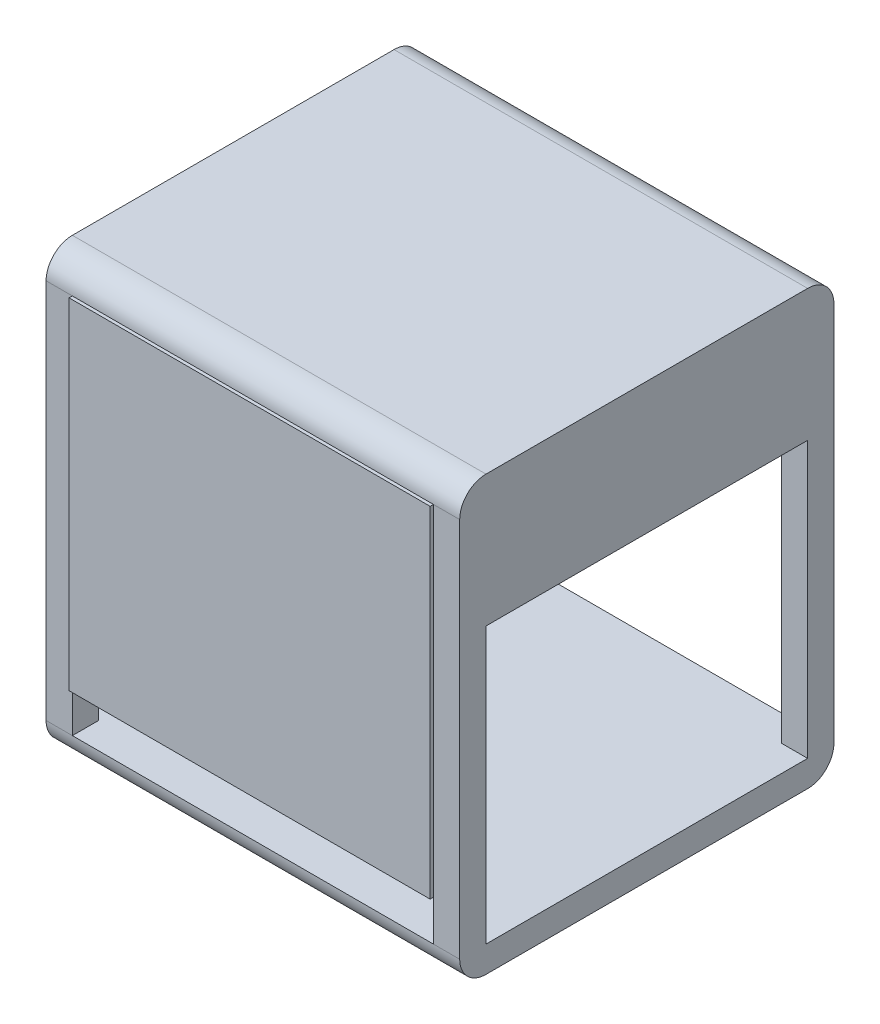
ISO-10303-21;
HEADER;
FILE_DESCRIPTION(('STEP AP214'),'2;1');
FILE_NAME('part.step','',(''),(''),'','','');
FILE_SCHEMA(('AUTOMOTIVE_DESIGN { 1 0 10303 214 1 1 1 1 }'));
ENDSEC;
DATA;
#1=APPLICATION_CONTEXT('core data for automotive mechanical design processes');
#2=APPLICATION_PROTOCOL_DEFINITION('international standard','automotive_design',2000,#1);
#3=PRODUCT_CONTEXT('',#1,'mechanical');
#4=PRODUCT('Part','Part','',(#3));
#5=PRODUCT_RELATED_PRODUCT_CATEGORY('part','',(#4));
#6=PRODUCT_DEFINITION_FORMATION('','',#4);
#7=PRODUCT_DEFINITION_CONTEXT('part definition',#1,'design');
#8=PRODUCT_DEFINITION('design','',#6,#7);
#9=PRODUCT_DEFINITION_SHAPE('','',#8);
#10=(LENGTH_UNIT() NAMED_UNIT(*) SI_UNIT(.MILLI.,.METRE.));
#11=(NAMED_UNIT(*) PLANE_ANGLE_UNIT() SI_UNIT($,.RADIAN.));
#12=(NAMED_UNIT(*) SI_UNIT($,.STERADIAN.) SOLID_ANGLE_UNIT());
#13=UNCERTAINTY_MEASURE_WITH_UNIT(LENGTH_MEASURE(1.E-05),#10,'distance_accuracy_value','');
#14=(GEOMETRIC_REPRESENTATION_CONTEXT(3) GLOBAL_UNCERTAINTY_ASSIGNED_CONTEXT((#13)) GLOBAL_UNIT_ASSIGNED_CONTEXT((#10,
#11,#12)) REPRESENTATION_CONTEXT('',''));
#15=CARTESIAN_POINT('',(0.,0.,0.));
#16=DIRECTION('',(0.,0.,1.));
#17=DIRECTION('',(1.,0.,0.));
#18=AXIS2_PLACEMENT_3D('',#15,#16,#17);
#19=CARTESIAN_POINT('',(590.,620.,5.));
#20=DIRECTION('',(-1.,0.,0.));
#21=DIRECTION('',(0.,0.,1.));
#22=AXIS2_PLACEMENT_3D('',#19,#20,#21);
#23=PLANE('',#22);
#24=DIRECTION('',(0.,1.,0.));
#25=VECTOR('',#24,1.);
#26=CARTESIAN_POINT('',(590.,620.,0.));
#27=LINE('',#26,#25);
#28=CARTESIAN_POINT('',(590.,101.80485531163,0.));
#29=VERTEX_POINT('',#28);
#30=CARTESIAN_POINT('',(590.,620.,0.));
#31=VERTEX_POINT('',#30);
#32=EDGE_CURVE('E108',#29,#31,#27,.T.);
#33=ORIENTED_EDGE('',*,*,#32,.T.);
#34=DIRECTION('',(0.,0.,-1.));
#35=VECTOR('',#34,1.);
#36=CARTESIAN_POINT('',(590.,620.,5.));
#37=LINE('',#36,#35);
#38=CARTESIAN_POINT('',(590.,620.,5.));
#39=VERTEX_POINT('',#38);
#40=EDGE_CURVE('E12',#39,#31,#37,.T.);
#41=ORIENTED_EDGE('',*,*,#40,.F.);
#42=DIRECTION('',(0.,1.,0.));
#43=VECTOR('',#42,1.);
#44=CARTESIAN_POINT('',(590.,620.,5.));
#45=LINE('',#44,#43);
#46=CARTESIAN_POINT('',(590.,101.80485531163,5.));
#47=VERTEX_POINT('',#46);
#48=EDGE_CURVE('E96',#47,#39,#45,.T.);
#49=ORIENTED_EDGE('',*,*,#48,.F.);
#50=DIRECTION('',(0.,0.,-1.));
#51=VECTOR('',#50,1.);
#52=CARTESIAN_POINT('',(590.,101.80485531163,5.));
#53=LINE('',#52,#51);
#54=EDGE_CURVE('E104',#47,#29,#53,.T.);
#55=ORIENTED_EDGE('',*,*,#54,.T.);
#56=EDGE_LOOP('',(#33,#41,#49,#55));
#57=FACE_BOUND('',#56,.T.);
#58=ADVANCED_FACE('F45',(#57),#23,.F.);
#59=CARTESIAN_POINT('',(590.,620.,5.));
#60=DIRECTION('',(0.,-1.,0.));
#61=DIRECTION('',(0.,0.,-1.));
#62=AXIS2_PLACEMENT_3D('',#59,#60,#61);
#63=PLANE('',#62);
#64=DIRECTION('',(-1.,0.,0.));
#65=VECTOR('',#64,1.);
#66=CARTESIAN_POINT('',(590.,620.,0.));
#67=LINE('',#66,#65);
#68=CARTESIAN_POINT('',(40.,620.,0.));
#69=VERTEX_POINT('',#68);
#70=EDGE_CURVE('E100',#31,#69,#67,.T.);
#71=ORIENTED_EDGE('',*,*,#70,.T.);
#72=DIRECTION('',(0.,0.,-1.));
#73=VECTOR('',#72,1.);
#74=CARTESIAN_POINT('',(40.,620.,5.));
#75=LINE('',#74,#73);
#76=CARTESIAN_POINT('',(40.,620.,5.));
#77=VERTEX_POINT('',#76);
#78=EDGE_CURVE('E53',#77,#69,#75,.T.);
#79=ORIENTED_EDGE('',*,*,#78,.F.);
#80=DIRECTION('',(-1.,0.,0.));
#81=VECTOR('',#80,1.);
#82=CARTESIAN_POINT('',(590.,620.,5.));
#83=LINE('',#82,#81);
#84=EDGE_CURVE('E91',#39,#77,#83,.T.);
#85=ORIENTED_EDGE('',*,*,#84,.F.);
#86=ORIENTED_EDGE('',*,*,#40,.T.);
#87=EDGE_LOOP('',(#71,#79,#85,#86));
#88=FACE_BOUND('',#87,.T.);
#89=ADVANCED_FACE('F99',(#88),#63,.F.);
#90=CARTESIAN_POINT('',(40.,620.,5.));
#91=DIRECTION('',(1.,0.,0.));
#92=DIRECTION('',(0.,0.,-1.));
#93=AXIS2_PLACEMENT_3D('',#90,#91,#92);
#94=PLANE('',#93);
#95=DIRECTION('',(0.,-1.,0.));
#96=VECTOR('',#95,1.);
#97=CARTESIAN_POINT('',(40.,620.,0.));
#98=LINE('',#97,#96);
#99=CARTESIAN_POINT('',(40.,101.80485531163,0.));
#100=VERTEX_POINT('',#99);
#101=EDGE_CURVE('E78',#69,#100,#98,.T.);
#102=ORIENTED_EDGE('',*,*,#101,.T.);
#103=DIRECTION('',(0.,0.,-1.));
#104=VECTOR('',#103,1.);
#105=CARTESIAN_POINT('',(40.,101.80485531163,5.));
#106=LINE('',#105,#104);
#107=CARTESIAN_POINT('',(40.,101.80485531163,5.));
#108=VERTEX_POINT('',#107);
#109=EDGE_CURVE('E101',#108,#100,#106,.T.);
#110=ORIENTED_EDGE('',*,*,#109,.F.);
#111=DIRECTION('',(0.,-1.,0.));
#112=VECTOR('',#111,1.);
#113=CARTESIAN_POINT('',(40.,620.,5.));
#114=LINE('',#113,#112);
#115=EDGE_CURVE('E94',#77,#108,#114,.T.);
#116=ORIENTED_EDGE('',*,*,#115,.F.);
#117=ORIENTED_EDGE('',*,*,#78,.T.);
#118=EDGE_LOOP('',(#102,#110,#116,#117));
#119=FACE_BOUND('',#118,.T.);
#120=ADVANCED_FACE('F102',(#119),#94,.F.);
#121=CARTESIAN_POINT('',(590.,101.80485531163,5.));
#122=DIRECTION('',(0.,1.,0.));
#123=DIRECTION('',(0.,0.,1.));
#124=AXIS2_PLACEMENT_3D('',#121,#122,#123);
#125=PLANE('',#124);
#126=DIRECTION('',(1.,0.,0.));
#127=VECTOR('',#126,1.);
#128=CARTESIAN_POINT('',(590.,101.80485531163,0.));
#129=LINE('',#128,#127);
#130=EDGE_CURVE('E84',#100,#29,#129,.T.);
#131=ORIENTED_EDGE('',*,*,#130,.T.);
#132=ORIENTED_EDGE('',*,*,#54,.F.);
#133=DIRECTION('',(1.,0.,0.));
#134=VECTOR('',#133,1.);
#135=CARTESIAN_POINT('',(590.,101.80485531163,5.));
#136=LINE('',#135,#134);
#137=EDGE_CURVE('E61',#108,#47,#136,.T.);
#138=ORIENTED_EDGE('',*,*,#137,.F.);
#139=ORIENTED_EDGE('',*,*,#109,.T.);
#140=EDGE_LOOP('',(#131,#132,#138,#139));
#141=FACE_BOUND('',#140,.T.);
#142=ADVANCED_FACE('F115',(#141),#125,.F.);
#143=CARTESIAN_POINT('',(0.,0.,5.));
#144=DIRECTION('',(0.,0.,-1.));
#145=DIRECTION('',(-1.,0.,0.));
#146=AXIS2_PLACEMENT_3D('',#143,#144,#145);
#147=PLANE('',#146);
#148=ORIENTED_EDGE('',*,*,#48,.T.);
#149=ORIENTED_EDGE('',*,*,#84,.T.);
#150=ORIENTED_EDGE('',*,*,#115,.T.);
#151=ORIENTED_EDGE('',*,*,#137,.T.);
#152=EDGE_LOOP('',(#148,#149,#150,#151));
#153=FACE_BOUND('',#152,.T.);
#154=ADVANCED_FACE('F92',(#153),#147,.F.);
#155=CARTESIAN_POINT('',(0.,0.,0.));
#156=DIRECTION('',(0.,0.,-1.));
#157=DIRECTION('',(-1.,0.,0.));
#158=AXIS2_PLACEMENT_3D('',#155,#156,#157);
#159=PLANE('',#158);
#160=ORIENTED_EDGE('',*,*,#32,.F.);
#161=ORIENTED_EDGE('',*,*,#130,.F.);
#162=ORIENTED_EDGE('',*,*,#101,.F.);
#163=ORIENTED_EDGE('',*,*,#70,.F.);
#164=EDGE_LOOP('',(#160,#161,#162,#163));
#165=FACE_BOUND('',#164,.T.);
#166=ADVANCED_FACE('F118',(#165),#159,.T.);
#167=CLOSED_SHELL('',(#58,#89,#120,#142,#154,#166));
#168=MANIFOLD_SOLID_BREP('B2',#167);
#169=CARTESIAN_POINT('',(102.769624477169,316.904934276251,-276.727693756087));
#170=DIRECTION('',(0.,1.,0.));
#171=DIRECTION('',(0.,0.,1.));
#172=AXIS2_PLACEMENT_3D('',#169,#170,#171);
#173=PLANE('',#172);
#174=DIRECTION('',(0.,0.,-1.));
#175=VECTOR('',#174,1.);
#176=CARTESIAN_POINT('',(102.769624477169,316.904934276251,-276.727693756087));
#177=LINE('',#176,#175);
#178=CARTESIAN_POINT('',(102.769624477169,316.904934276251,-276.727693756087));
#179=VERTEX_POINT('',#178);
#180=CARTESIAN_POINT('',(102.769624477169,316.904934276251,-336.727693756087));
#181=VERTEX_POINT('',#180);
#182=EDGE_CURVE('E369',#179,#181,#177,.T.);
#183=ORIENTED_EDGE('',*,*,#182,.T.);
#184=DIRECTION('',(1.,0.,0.));
#185=VECTOR('',#184,1.);
#186=CARTESIAN_POINT('',(102.769624477169,316.904934276251,-336.727693756087));
#187=LINE('',#186,#185);
#188=CARTESIAN_POINT('',(181.340018819664,316.904934276251,-336.727693756087));
#189=VERTEX_POINT('',#188);
#190=EDGE_CURVE('E374',#181,#189,#187,.T.);
#191=ORIENTED_EDGE('',*,*,#190,.T.);
#192=DIRECTION('',(0.,0.,-1.));
#193=VECTOR('',#192,1.);
#194=CARTESIAN_POINT('',(181.340018819664,316.904934276251,-276.727693756087));
#195=LINE('',#194,#193);
#196=CARTESIAN_POINT('',(181.340018819664,316.904934276251,-276.727693756087));
#197=VERTEX_POINT('',#196);
#198=EDGE_CURVE('E384',#197,#189,#195,.T.);
#199=ORIENTED_EDGE('',*,*,#198,.F.);
#200=DIRECTION('',(1.,0.,0.));
#201=VECTOR('',#200,1.);
#202=CARTESIAN_POINT('',(102.769624477169,316.904934276251,-276.727693756087));
#203=LINE('',#202,#201);
#204=EDGE_CURVE('E381',#179,#197,#203,.T.);
#205=ORIENTED_EDGE('',*,*,#204,.F.);
#206=EDGE_LOOP('',(#183,#191,#199,#205));
#207=FACE_BOUND('',#206,.T.);
#208=CARTESIAN_POINT('',(141.069612941928,316.904934276251,-317.368211044439));
#209=DIRECTION('',(0.,1.,0.));
#210=DIRECTION('',(0.,0.,1.));
#211=AXIS2_PLACEMENT_3D('',#208,#209,#210);
#212=CIRCLE('',#211,11.2486982762184);
#213=CARTESIAN_POINT('',(141.069612941928,316.904934276251,-306.119512768221));
#214=VERTEX_POINT('',#213);
#215=EDGE_CURVE('E43',#214,#214,#212,.F.);
#216=ORIENTED_EDGE('',*,*,#215,.F.);
#217=EDGE_LOOP('',(#216));
#218=FACE_BOUND('',#217,.T.);
#219=ADVANCED_FACE('F168',(#207,#218),#173,.F.);
#220=CARTESIAN_POINT('',(40.,620.,660.));
#221=DIRECTION('',(0.,-1.,0.));
#222=DIRECTION('',(0.,0.,-1.));
#223=AXIS2_PLACEMENT_3D('',#220,#221,#222);
#224=PLANE('',#223);
#225=DIRECTION('',(1.,0.,0.));
#226=VECTOR('',#225,1.);
#227=CARTESIAN_POINT('',(40.,620.,-326.727693756087));
#228=LINE('',#227,#226);
#229=CARTESIAN_POINT('',(40.,620.,-326.727693756087));
#230=VERTEX_POINT('',#229);
#231=CARTESIAN_POINT('',(102.769624477169,620.,-326.727693756087));
#232=VERTEX_POINT('',#231);
#233=EDGE_CURVE('E583',#230,#232,#228,.T.);
#234=ORIENTED_EDGE('',*,*,#233,.T.);
#235=DIRECTION('',(0.,0.,-1.));
#236=VECTOR('',#235,1.);
#237=CARTESIAN_POINT('',(102.769624477169,620.,-276.727693756087));
#238=LINE('',#237,#236);
#239=CARTESIAN_POINT('',(102.769624477169,620.,-276.727693756087));
#240=VERTEX_POINT('',#239);
#241=EDGE_CURVE('E183',#240,#232,#238,.T.);
#242=ORIENTED_EDGE('',*,*,#241,.F.);
#243=DIRECTION('',(-1.,0.,0.));
#244=VECTOR('',#243,1.);
#245=CARTESIAN_POINT('',(102.769624477169,620.,-276.727693756087));
#246=LINE('',#245,#244);
#247=CARTESIAN_POINT('',(181.340018819664,620.,-276.727693756087));
#248=VERTEX_POINT('',#247);
#249=EDGE_CURVE('E187',#248,#240,#246,.T.);
#250=ORIENTED_EDGE('',*,*,#249,.F.);
#251=DIRECTION('',(0.,0.,-1.));
#252=VECTOR('',#251,1.);
#253=CARTESIAN_POINT('',(181.340018819664,620.,-276.727693756087));
#254=LINE('',#253,#252);
#255=CARTESIAN_POINT('',(181.340018819664,620.,-326.727693756087));
#256=VERTEX_POINT('',#255);
#257=EDGE_CURVE('E401',#248,#256,#254,.T.);
#258=ORIENTED_EDGE('',*,*,#257,.T.);
#259=CARTESIAN_POINT('',(590.,620.,-326.727693756087));
#260=VERTEX_POINT('',#259);
#261=EDGE_CURVE('E582',#256,#260,#228,.T.);
#262=ORIENTED_EDGE('',*,*,#261,.T.);
#263=DIRECTION('',(0.,0.,-1.));
#264=VECTOR('',#263,1.);
#265=CARTESIAN_POINT('',(590.,620.,660.));
#266=LINE('',#265,#264);
#267=CARTESIAN_POINT('',(590.,620.,0.));
#268=VERTEX_POINT('',#267);
#269=EDGE_CURVE('E483',#268,#260,#266,.T.);
#270=ORIENTED_EDGE('',*,*,#269,.F.);
#271=DIRECTION('',(1.,0.,0.));
#272=VECTOR('',#271,1.);
#273=CARTESIAN_POINT('',(0.,620.,0.));
#274=LINE('',#273,#272);
#275=CARTESIAN_POINT('',(40.,620.,0.));
#276=VERTEX_POINT('',#275);
#277=EDGE_CURVE('E574',#268,#276,#274,.F.);
#278=ORIENTED_EDGE('',*,*,#277,.T.);
#279=DIRECTION('',(0.,0.,-1.));
#280=VECTOR('',#279,1.);
#281=CARTESIAN_POINT('',(40.,620.,660.));
#282=LINE('',#281,#280);
#283=EDGE_CURVE('E479',#276,#230,#282,.T.);
#284=ORIENTED_EDGE('',*,*,#283,.T.);
#285=EDGE_LOOP('',(#234,#242,#250,#258,#262,#270,#278,#284));
#286=FACE_BOUND('',#285,.T.);
#287=ADVANCED_FACE('F610',(#286),#224,.T.);
#288=CARTESIAN_POINT('',(11.5967687641698,520.,-326.727693756087));
#289=DIRECTION('',(0.,0.,-1.));
#290=DIRECTION('',(-1.,0.,0.));
#291=AXIS2_PLACEMENT_3D('',#288,#289,#290);
#292=PLANE('',#291);
#293=DIRECTION('',(0.,-1.,0.));
#294=VECTOR('',#293,1.);
#295=CARTESIAN_POINT('',(102.769624477169,520.,-326.727693756087));
#296=LINE('',#295,#294);
#297=CARTESIAN_POINT('',(102.769624477169,520.,-326.727693756087));
#298=VERTEX_POINT('',#297);
#299=EDGE_CURVE('E406',#232,#298,#296,.T.);
#300=ORIENTED_EDGE('',*,*,#299,.F.);
#301=ORIENTED_EDGE('',*,*,#233,.F.);
#302=DIRECTION('',(0.,1.,0.));
#303=VECTOR('',#302,1.);
#304=CARTESIAN_POINT('',(40.,620.,-326.727693756087));
#305=LINE('',#304,#303);
#306=CARTESIAN_POINT('',(40.,520.,-326.727693756087));
#307=VERTEX_POINT('',#306);
#308=EDGE_CURVE('E418',#307,#230,#305,.T.);
#309=ORIENTED_EDGE('',*,*,#308,.F.);
#310=DIRECTION('',(-1.,0.,0.));
#311=VECTOR('',#310,1.);
#312=CARTESIAN_POINT('',(11.5967687641698,520.,-326.727693756087));
#313=LINE('',#312,#311);
#314=EDGE_CURVE('E411',#298,#307,#313,.T.);
#315=ORIENTED_EDGE('',*,*,#314,.F.);
#316=EDGE_LOOP('',(#300,#301,#309,#315));
#317=FACE_BOUND('',#316,.T.);
#318=ADVANCED_FACE('F617',(#317),#292,.F.);
#319=DIRECTION('',(0.,1.,0.));
#320=VECTOR('',#319,1.);
#321=CARTESIAN_POINT('',(181.340018819664,520.,-326.727693756087));
#322=LINE('',#321,#320);
#323=CARTESIAN_POINT('',(181.340018819664,520.,-326.727693756087));
#324=VERTEX_POINT('',#323);
#325=EDGE_CURVE('E383',#324,#256,#322,.T.);
#326=ORIENTED_EDGE('',*,*,#325,.F.);
#327=CARTESIAN_POINT('',(590.,520.,-326.727693756087));
#328=VERTEX_POINT('',#327);
#329=EDGE_CURVE('E412',#328,#324,#313,.T.);
#330=ORIENTED_EDGE('',*,*,#329,.F.);
#331=DIRECTION('',(0.,-1.,0.));
#332=VECTOR('',#331,1.);
#333=CARTESIAN_POINT('',(590.,620.,-326.727693756087));
#334=LINE('',#333,#332);
#335=EDGE_CURVE('E415',#260,#328,#334,.T.);
#336=ORIENTED_EDGE('',*,*,#335,.F.);
#337=ORIENTED_EDGE('',*,*,#261,.F.);
#338=EDGE_LOOP('',(#326,#330,#336,#337));
#339=FACE_BOUND('',#338,.T.);
#340=ADVANCED_FACE('F603',(#339),#292,.F.);
#341=CARTESIAN_POINT('',(0.,520.,0.));
#342=DIRECTION('',(0.,1.,0.));
#343=DIRECTION('',(0.,0.,1.));
#344=AXIS2_PLACEMENT_3D('',#341,#342,#343);
#345=PLANE('',#344);
#346=DIRECTION('',(0.,0.,-1.));
#347=VECTOR('',#346,1.);
#348=CARTESIAN_POINT('',(102.769624477169,520.,0.));
#349=LINE('',#348,#347);
#350=CARTESIAN_POINT('',(102.769624477169,520.,-336.727693756087));
#351=VERTEX_POINT('',#350);
#352=EDGE_CURVE('E176',#298,#351,#349,.T.);
#353=ORIENTED_EDGE('',*,*,#352,.F.);
#354=ORIENTED_EDGE('',*,*,#314,.T.);
#355=DIRECTION('',(0.,0.,1.));
#356=VECTOR('',#355,1.);
#357=CARTESIAN_POINT('',(40.,520.,660.));
#358=LINE('',#357,#356);
#359=CARTESIAN_POINT('',(40.,520.,-374.305064206949));
#360=VERTEX_POINT('',#359);
#361=EDGE_CURVE('E427',#360,#307,#358,.T.);
#362=ORIENTED_EDGE('',*,*,#361,.F.);
#363=DIRECTION('',(1.,0.,0.));
#364=VECTOR('',#363,1.);
#365=CARTESIAN_POINT('',(11.5967687641698,520.,-374.305064206949));
#366=LINE('',#365,#364);
#367=CARTESIAN_POINT('',(590.,520.,-374.305064206949));
#368=VERTEX_POINT('',#367);
#369=EDGE_CURVE('E408',#360,#368,#366,.T.);
#370=ORIENTED_EDGE('',*,*,#369,.T.);
#371=DIRECTION('',(0.,0.,-1.));
#372=VECTOR('',#371,1.);
#373=CARTESIAN_POINT('',(590.,520.,660.));
#374=LINE('',#373,#372);
#375=EDGE_CURVE('E588',#328,#368,#374,.T.);
#376=ORIENTED_EDGE('',*,*,#375,.F.);
#377=ORIENTED_EDGE('',*,*,#329,.T.);
#378=DIRECTION('',(0.,0.,1.));
#379=VECTOR('',#378,1.);
#380=CARTESIAN_POINT('',(181.340018819664,520.,0.));
#381=LINE('',#380,#379);
#382=CARTESIAN_POINT('',(181.340018819664,520.,-336.727693756087));
#383=VERTEX_POINT('',#382);
#384=EDGE_CURVE('E593',#383,#324,#381,.T.);
#385=ORIENTED_EDGE('',*,*,#384,.F.);
#386=DIRECTION('',(1.,0.,0.));
#387=VECTOR('',#386,1.);
#388=CARTESIAN_POINT('',(0.,520.,-336.727693756087));
#389=LINE('',#388,#387);
#390=EDGE_CURVE('E591',#351,#383,#389,.T.);
#391=ORIENTED_EDGE('',*,*,#390,.F.);
#392=EDGE_LOOP('',(#353,#354,#362,#370,#376,#377,#385,#391));
#393=FACE_BOUND('',#392,.T.);
#394=ADVANCED_FACE('F599',(#393),#345,.F.);
#395=CARTESIAN_POINT('',(40.,620.,660.));
#396=DIRECTION('',(1.,0.,0.));
#397=DIRECTION('',(0.,0.,-1.));
#398=AXIS2_PLACEMENT_3D('',#395,#396,#397);
#399=PLANE('',#398);
#400=CARTESIAN_POINT('',(40.,620.,-374.305064206949));
#401=VERTEX_POINT('',#400);
#402=CARTESIAN_POINT('',(40.,620.,-570.));
#403=VERTEX_POINT('',#402);
#404=EDGE_CURVE('E478',#401,#403,#282,.T.);
#405=ORIENTED_EDGE('',*,*,#404,.F.);
#406=DIRECTION('',(0.,-1.,0.));
#407=VECTOR('',#406,1.);
#408=CARTESIAN_POINT('',(40.,620.,-374.305064206949));
#409=LINE('',#408,#407);
#410=EDGE_CURVE('E424',#401,#360,#409,.T.);
#411=ORIENTED_EDGE('',*,*,#410,.T.);
#412=ORIENTED_EDGE('',*,*,#361,.T.);
#413=ORIENTED_EDGE('',*,*,#308,.T.);
#414=ORIENTED_EDGE('',*,*,#283,.F.);
#415=DIRECTION('',(0.,-1.,0.));
#416=VECTOR('',#415,1.);
#417=CARTESIAN_POINT('',(40.,660.,0.));
#418=LINE('',#417,#416);
#419=CARTESIAN_POINT('',(40.,40.,0.));
#420=VERTEX_POINT('',#419);
#421=EDGE_CURVE('E506',#276,#420,#418,.T.);
#422=ORIENTED_EDGE('',*,*,#421,.T.);
#423=DIRECTION('',(0.,0.,-1.));
#424=VECTOR('',#423,1.);
#425=CARTESIAN_POINT('',(40.,40.,660.));
#426=LINE('',#425,#424);
#427=CARTESIAN_POINT('',(40.,40.,-40.));
#428=VERTEX_POINT('',#427);
#429=EDGE_CURVE('E491',#420,#428,#426,.T.);
#430=ORIENTED_EDGE('',*,*,#429,.T.);
#431=DIRECTION('',(0.,1.,0.));
#432=VECTOR('',#431,1.);
#433=CARTESIAN_POINT('',(40.,620.,-40.));
#434=LINE('',#433,#432);
#435=CARTESIAN_POINT('',(40.,459.595995266071,-40.));
#436=VERTEX_POINT('',#435);
#437=EDGE_CURVE('E459',#428,#436,#434,.T.);
#438=ORIENTED_EDGE('',*,*,#437,.T.);
#439=DIRECTION('',(0.,0.,-1.));
#440=VECTOR('',#439,1.);
#441=CARTESIAN_POINT('',(40.,459.595995266071,660.));
#442=LINE('',#441,#440);
#443=CARTESIAN_POINT('',(40.,459.595995266071,-530.));
#444=VERTEX_POINT('',#443);
#445=EDGE_CURVE('E467',#436,#444,#442,.T.);
#446=ORIENTED_EDGE('',*,*,#445,.T.);
#447=DIRECTION('',(0.,-1.,0.));
#448=VECTOR('',#447,1.);
#449=CARTESIAN_POINT('',(40.,620.,-530.));
#450=LINE('',#449,#448);
#451=CARTESIAN_POINT('',(40.,40.,-530.));
#452=VERTEX_POINT('',#451);
#453=EDGE_CURVE('E448',#444,#452,#450,.T.);
#454=ORIENTED_EDGE('',*,*,#453,.T.);
#455=CARTESIAN_POINT('',(40.,40.,-570.));
#456=VERTEX_POINT('',#455);
#457=EDGE_CURVE('E490',#452,#456,#426,.T.);
#458=ORIENTED_EDGE('',*,*,#457,.T.);
#459=DIRECTION('',(0.,1.,0.));
#460=VECTOR('',#459,1.);
#461=CARTESIAN_POINT('',(40.,660.,-570.));
#462=LINE('',#461,#460);
#463=EDGE_CURVE('E503',#456,#403,#462,.T.);
#464=ORIENTED_EDGE('',*,*,#463,.T.);
#465=EDGE_LOOP('',(#405,#411,#412,#413,#414,#422,#430,#438,#446,#454,#458,#464));
#466=FACE_BOUND('',#465,.T.);
#467=ADVANCED_FACE('F622',(#466),#399,.T.);
#468=CARTESIAN_POINT('',(590.,620.,660.));
#469=DIRECTION('',(-1.,0.,0.));
#470=DIRECTION('',(0.,0.,1.));
#471=AXIS2_PLACEMENT_3D('',#468,#469,#470);
#472=PLANE('',#471);
#473=ORIENTED_EDGE('',*,*,#375,.T.);
#474=DIRECTION('',(0.,1.,0.));
#475=VECTOR('',#474,1.);
#476=CARTESIAN_POINT('',(590.,620.,-374.305064206949));
#477=LINE('',#476,#475);
#478=CARTESIAN_POINT('',(590.,620.,-374.305064206949));
#479=VERTEX_POINT('',#478);
#480=EDGE_CURVE('E421',#368,#479,#477,.T.);
#481=ORIENTED_EDGE('',*,*,#480,.T.);
#482=CARTESIAN_POINT('',(590.,620.,-570.));
#483=VERTEX_POINT('',#482);
#484=EDGE_CURVE('E482',#479,#483,#266,.T.);
#485=ORIENTED_EDGE('',*,*,#484,.T.);
#486=DIRECTION('',(0.,-1.,0.));
#487=VECTOR('',#486,1.);
#488=CARTESIAN_POINT('',(590.,660.,-570.));
#489=LINE('',#488,#487);
#490=CARTESIAN_POINT('',(590.,40.,-570.));
#491=VERTEX_POINT('',#490);
#492=EDGE_CURVE('E497',#483,#491,#489,.T.);
#493=ORIENTED_EDGE('',*,*,#492,.T.);
#494=DIRECTION('',(0.,0.,-1.));
#495=VECTOR('',#494,1.);
#496=CARTESIAN_POINT('',(590.,40.,660.));
#497=LINE('',#496,#495);
#498=CARTESIAN_POINT('',(590.,40.,-530.));
#499=VERTEX_POINT('',#498);
#500=EDGE_CURVE('E486',#499,#491,#497,.T.);
#501=ORIENTED_EDGE('',*,*,#500,.F.);
#502=DIRECTION('',(0.,1.,0.));
#503=VECTOR('',#502,1.);
#504=CARTESIAN_POINT('',(590.,620.,-530.));
#505=LINE('',#504,#503);
#506=CARTESIAN_POINT('',(590.,459.595995266071,-530.));
#507=VERTEX_POINT('',#506);
#508=EDGE_CURVE('E445',#499,#507,#505,.T.);
#509=ORIENTED_EDGE('',*,*,#508,.T.);
#510=DIRECTION('',(0.,0.,1.));
#511=VECTOR('',#510,1.);
#512=CARTESIAN_POINT('',(590.,459.595995266071,660.));
#513=LINE('',#512,#511);
#514=CARTESIAN_POINT('',(590.,459.595995266071,-40.));
#515=VERTEX_POINT('',#514);
#516=EDGE_CURVE('E578',#507,#515,#513,.T.);
#517=ORIENTED_EDGE('',*,*,#516,.T.);
#518=DIRECTION('',(0.,-1.,0.));
#519=VECTOR('',#518,1.);
#520=CARTESIAN_POINT('',(590.,620.,-40.));
#521=LINE('',#520,#519);
#522=CARTESIAN_POINT('',(590.,40.,-40.));
#523=VERTEX_POINT('',#522);
#524=EDGE_CURVE('E456',#515,#523,#521,.T.);
#525=ORIENTED_EDGE('',*,*,#524,.T.);
#526=CARTESIAN_POINT('',(590.,40.,0.));
#527=VERTEX_POINT('',#526);
#528=EDGE_CURVE('E487',#527,#523,#497,.T.);
#529=ORIENTED_EDGE('',*,*,#528,.F.);
#530=DIRECTION('',(0.,1.,0.));
#531=VECTOR('',#530,1.);
#532=CARTESIAN_POINT('',(590.,660.,0.));
#533=LINE('',#532,#531);
#534=EDGE_CURVE('E500',#527,#268,#533,.T.);
#535=ORIENTED_EDGE('',*,*,#534,.T.);
#536=ORIENTED_EDGE('',*,*,#269,.T.);
#537=ORIENTED_EDGE('',*,*,#335,.T.);
#538=EDGE_LOOP('',(#473,#481,#485,#493,#501,#509,#517,#525,#529,#535,#536,#537));
#539=FACE_BOUND('',#538,.T.);
#540=ADVANCED_FACE('F606',(#539),#472,.T.);
#541=ORIENTED_EDGE('',*,*,#484,.F.);
#542=DIRECTION('',(-1.,0.,0.));
#543=VECTOR('',#542,1.);
#544=CARTESIAN_POINT('',(40.,620.,-374.305064206949));
#545=LINE('',#544,#543);
#546=EDGE_CURVE('E585',#479,#401,#545,.T.);
#547=ORIENTED_EDGE('',*,*,#546,.T.);
#548=ORIENTED_EDGE('',*,*,#404,.T.);
#549=DIRECTION('',(-1.,0.,0.));
#550=VECTOR('',#549,1.);
#551=CARTESIAN_POINT('',(0.,620.,-570.));
#552=LINE('',#551,#550);
#553=EDGE_CURVE('E494',#483,#403,#552,.T.);
#554=ORIENTED_EDGE('',*,*,#553,.F.);
#555=EDGE_LOOP('',(#541,#547,#548,#554));
#556=FACE_BOUND('',#555,.T.);
#557=ADVANCED_FACE('F688',(#556),#224,.T.);
#558=CARTESIAN_POINT('',(0.,660.,0.));
#559=DIRECTION('',(1.,0.,0.));
#560=DIRECTION('',(0.,0.,-1.));
#561=AXIS2_PLACEMENT_3D('',#558,#559,#560);
#562=PLANE('',#561);
#563=DIRECTION('',(0.,-1.,0.));
#564=VECTOR('',#563,1.);
#565=CARTESIAN_POINT('',(0.,660.,-570.));
#566=LINE('',#565,#564);
#567=CARTESIAN_POINT('',(0.,620.,-570.));
#568=VERTEX_POINT('',#567);
#569=CARTESIAN_POINT('',(0.,40.,-570.));
#570=VERTEX_POINT('',#569);
#571=EDGE_CURVE('E519',#568,#570,#566,.T.);
#572=ORIENTED_EDGE('',*,*,#571,.T.);
#573=CARTESIAN_POINT('',(0.,40.,-530.));
#574=DIRECTION('',(1.,0.,0.));
#575=DIRECTION('',(0.,0.,-1.));
#576=AXIS2_PLACEMENT_3D('',#573,#574,#575);
#577=CIRCLE('',#576,40.);
#578=CARTESIAN_POINT('',(0.,0.,-530.));
#579=VERTEX_POINT('',#578);
#580=EDGE_CURVE('E549',#570,#579,#577,.F.);
#581=ORIENTED_EDGE('',*,*,#580,.T.);
#582=DIRECTION('',(0.,0.,1.));
#583=VECTOR('',#582,1.);
#584=CARTESIAN_POINT('',(0.,0.,0.));
#585=LINE('',#584,#583);
#586=CARTESIAN_POINT('',(0.,0.,-40.));
#587=VERTEX_POINT('',#586);
#588=EDGE_CURVE('E511',#579,#587,#585,.T.);
#589=ORIENTED_EDGE('',*,*,#588,.T.);
#590=CARTESIAN_POINT('',(0.,40.,-40.));
#591=DIRECTION('',(1.,0.,0.));
#592=DIRECTION('',(0.,0.,-1.));
#593=AXIS2_PLACEMENT_3D('',#590,#591,#592);
#594=CIRCLE('',#593,40.);
#595=CARTESIAN_POINT('',(0.,40.,0.));
#596=VERTEX_POINT('',#595);
#597=EDGE_CURVE('E545',#587,#596,#594,.F.);
#598=ORIENTED_EDGE('',*,*,#597,.T.);
#599=DIRECTION('',(0.,-1.,0.));
#600=VECTOR('',#599,1.);
#601=CARTESIAN_POINT('',(0.,660.,0.));
#602=LINE('',#601,#600);
#603=CARTESIAN_POINT('',(0.,620.,0.));
#604=VERTEX_POINT('',#603);
#605=EDGE_CURVE('E532',#604,#596,#602,.T.);
#606=ORIENTED_EDGE('',*,*,#605,.F.);
#607=CARTESIAN_POINT('',(0.,620.,-40.));
#608=DIRECTION('',(1.,0.,0.));
#609=DIRECTION('',(0.,0.,-1.));
#610=AXIS2_PLACEMENT_3D('',#607,#608,#609);
#611=CIRCLE('',#610,40.);
#612=CARTESIAN_POINT('',(0.,660.,-40.));
#613=VERTEX_POINT('',#612);
#614=EDGE_CURVE('E543',#604,#613,#611,.F.);
#615=ORIENTED_EDGE('',*,*,#614,.T.);
#616=DIRECTION('',(0.,0.,1.));
#617=VECTOR('',#616,1.);
#618=CARTESIAN_POINT('',(0.,660.,0.));
#619=LINE('',#618,#617);
#620=CARTESIAN_POINT('',(0.,660.,-530.));
#621=VERTEX_POINT('',#620);
#622=EDGE_CURVE('E512',#621,#613,#619,.T.);
#623=ORIENTED_EDGE('',*,*,#622,.F.);
#624=CARTESIAN_POINT('',(0.,620.,-530.));
#625=DIRECTION('',(1.,0.,0.));
#626=DIRECTION('',(0.,0.,-1.));
#627=AXIS2_PLACEMENT_3D('',#624,#625,#626);
#628=CIRCLE('',#627,40.);
#629=EDGE_CURVE('E547',#621,#568,#628,.F.);
#630=ORIENTED_EDGE('',*,*,#629,.T.);
#631=EDGE_LOOP('',(#572,#581,#589,#598,#606,#615,#623,#630));
#632=FACE_BOUND('',#631,.T.);
#633=DIRECTION('',(0.,1.,0.));
#634=VECTOR('',#633,1.);
#635=CARTESIAN_POINT('',(0.,660.,-40.));
#636=LINE('',#635,#634);
#637=CARTESIAN_POINT('',(0.,40.,-40.));
#638=VERTEX_POINT('',#637);
#639=CARTESIAN_POINT('',(0.,459.595995266071,-40.));
#640=VERTEX_POINT('',#639);
#641=EDGE_CURVE('E464',#638,#640,#636,.T.);
#642=ORIENTED_EDGE('',*,*,#641,.F.);
#643=DIRECTION('',(0.,0.,1.));
#644=VECTOR('',#643,1.);
#645=CARTESIAN_POINT('',(0.,40.,0.));
#646=LINE('',#645,#644);
#647=CARTESIAN_POINT('',(0.,40.,-530.));
#648=VERTEX_POINT('',#647);
#649=EDGE_CURVE('E476',#648,#638,#646,.T.);
#650=ORIENTED_EDGE('',*,*,#649,.F.);
#651=DIRECTION('',(0.,-1.,0.));
#652=VECTOR('',#651,1.);
#653=CARTESIAN_POINT('',(0.,660.,-530.));
#654=LINE('',#653,#652);
#655=CARTESIAN_POINT('',(0.,459.595995266071,-530.));
#656=VERTEX_POINT('',#655);
#657=EDGE_CURVE('E454',#656,#648,#654,.T.);
#658=ORIENTED_EDGE('',*,*,#657,.F.);
#659=DIRECTION('',(0.,0.,-1.));
#660=VECTOR('',#659,1.);
#661=CARTESIAN_POINT('',(0.,459.595995266071,0.));
#662=LINE('',#661,#660);
#663=EDGE_CURVE('E472',#640,#656,#662,.T.);
#664=ORIENTED_EDGE('',*,*,#663,.F.);
#665=EDGE_LOOP('',(#642,#650,#658,#664));
#666=FACE_BOUND('',#665,.T.);
#667=ADVANCED_FACE('F635',(#632,#666),#562,.F.);
#668=CARTESIAN_POINT('',(630.,660.,0.));
#669=DIRECTION('',(-1.,0.,0.));
#670=DIRECTION('',(0.,0.,1.));
#671=AXIS2_PLACEMENT_3D('',#668,#669,#670);
#672=PLANE('',#671);
#673=DIRECTION('',(0.,0.,-1.));
#674=VECTOR('',#673,1.);
#675=CARTESIAN_POINT('',(630.,0.,0.));
#676=LINE('',#675,#674);
#677=CARTESIAN_POINT('',(630.,0.,-40.));
#678=VERTEX_POINT('',#677);
#679=CARTESIAN_POINT('',(630.,0.,-530.));
#680=VERTEX_POINT('',#679);
#681=EDGE_CURVE('E516',#678,#680,#676,.T.);
#682=ORIENTED_EDGE('',*,*,#681,.T.);
#683=CARTESIAN_POINT('',(630.,40.,-530.));
#684=DIRECTION('',(-1.,0.,0.));
#685=DIRECTION('',(0.,0.,1.));
#686=AXIS2_PLACEMENT_3D('',#683,#684,#685);
#687=CIRCLE('',#686,40.);
#688=CARTESIAN_POINT('',(630.,40.,-570.));
#689=VERTEX_POINT('',#688);
#690=EDGE_CURVE('E561',#680,#689,#687,.F.);
#691=ORIENTED_EDGE('',*,*,#690,.T.);
#692=DIRECTION('',(0.,-1.,0.));
#693=VECTOR('',#692,1.);
#694=CARTESIAN_POINT('',(630.,660.,-570.));
#695=LINE('',#694,#693);
#696=CARTESIAN_POINT('',(630.,620.,-570.));
#697=VERTEX_POINT('',#696);
#698=EDGE_CURVE('E526',#697,#689,#695,.T.);
#699=ORIENTED_EDGE('',*,*,#698,.F.);
#700=CARTESIAN_POINT('',(630.,620.,-530.));
#701=DIRECTION('',(-1.,0.,0.));
#702=DIRECTION('',(0.,0.,1.));
#703=AXIS2_PLACEMENT_3D('',#700,#701,#702);
#704=CIRCLE('',#703,40.);
#705=CARTESIAN_POINT('',(630.,660.,-530.));
#706=VERTEX_POINT('',#705);
#707=EDGE_CURVE('E559',#697,#706,#704,.F.);
#708=ORIENTED_EDGE('',*,*,#707,.T.);
#709=DIRECTION('',(0.,0.,-1.));
#710=VECTOR('',#709,1.);
#711=CARTESIAN_POINT('',(630.,660.,0.));
#712=LINE('',#711,#710);
#713=CARTESIAN_POINT('',(630.,660.,-40.));
#714=VERTEX_POINT('',#713);
#715=EDGE_CURVE('E515',#714,#706,#712,.T.);
#716=ORIENTED_EDGE('',*,*,#715,.F.);
#717=CARTESIAN_POINT('',(630.,620.,-40.));
#718=DIRECTION('',(-1.,0.,0.));
#719=DIRECTION('',(0.,0.,1.));
#720=AXIS2_PLACEMENT_3D('',#717,#718,#719);
#721=CIRCLE('',#720,40.);
#722=CARTESIAN_POINT('',(630.,620.,0.));
#723=VERTEX_POINT('',#722);
#724=EDGE_CURVE('E555',#714,#723,#721,.F.);
#725=ORIENTED_EDGE('',*,*,#724,.T.);
#726=DIRECTION('',(0.,-1.,0.));
#727=VECTOR('',#726,1.);
#728=CARTESIAN_POINT('',(630.,660.,0.));
#729=LINE('',#728,#727);
#730=CARTESIAN_POINT('',(630.,40.,0.));
#731=VERTEX_POINT('',#730);
#732=EDGE_CURVE('E529',#723,#731,#729,.T.);
#733=ORIENTED_EDGE('',*,*,#732,.T.);
#734=CARTESIAN_POINT('',(630.,40.,-40.));
#735=DIRECTION('',(-1.,0.,0.));
#736=DIRECTION('',(0.,0.,1.));
#737=AXIS2_PLACEMENT_3D('',#734,#735,#736);
#738=CIRCLE('',#737,40.);
#739=EDGE_CURVE('E557',#731,#678,#738,.F.);
#740=ORIENTED_EDGE('',*,*,#739,.T.);
#741=EDGE_LOOP('',(#682,#691,#699,#708,#716,#725,#733,#740));
#742=FACE_BOUND('',#741,.T.);
#743=DIRECTION('',(0.,-1.,0.));
#744=VECTOR('',#743,1.);
#745=CARTESIAN_POINT('',(630.,660.,-40.));
#746=LINE('',#745,#744);
#747=CARTESIAN_POINT('',(630.,459.595995266071,-40.));
#748=VERTEX_POINT('',#747);
#749=CARTESIAN_POINT('',(630.,40.,-40.));
#750=VERTEX_POINT('',#749);
#751=EDGE_CURVE('E462',#748,#750,#746,.T.);
#752=ORIENTED_EDGE('',*,*,#751,.F.);
#753=DIRECTION('',(0.,0.,1.));
#754=VECTOR('',#753,1.);
#755=CARTESIAN_POINT('',(630.,459.595995266071,0.));
#756=LINE('',#755,#754);
#757=CARTESIAN_POINT('',(630.,459.595995266071,-530.));
#758=VERTEX_POINT('',#757);
#759=EDGE_CURVE('E470',#758,#748,#756,.T.);
#760=ORIENTED_EDGE('',*,*,#759,.F.);
#761=DIRECTION('',(0.,1.,0.));
#762=VECTOR('',#761,1.);
#763=CARTESIAN_POINT('',(630.,660.,-530.));
#764=LINE('',#763,#762);
#765=CARTESIAN_POINT('',(630.,40.,-530.));
#766=VERTEX_POINT('',#765);
#767=EDGE_CURVE('E451',#766,#758,#764,.T.);
#768=ORIENTED_EDGE('',*,*,#767,.F.);
#769=DIRECTION('',(0.,0.,-1.));
#770=VECTOR('',#769,1.);
#771=CARTESIAN_POINT('',(630.,40.,0.));
#772=LINE('',#771,#770);
#773=EDGE_CURVE('E474',#750,#766,#772,.T.);
#774=ORIENTED_EDGE('',*,*,#773,.F.);
#775=EDGE_LOOP('',(#752,#760,#768,#774));
#776=FACE_BOUND('',#775,.T.);
#777=ADVANCED_FACE('F672',(#742,#776),#672,.F.);
#778=CARTESIAN_POINT('',(0.,660.,0.));
#779=DIRECTION('',(0.,0.,-1.));
#780=DIRECTION('',(-1.,0.,0.));
#781=AXIS2_PLACEMENT_3D('',#778,#779,#780);
#782=PLANE('',#781);
#783=ORIENTED_EDGE('',*,*,#421,.F.);
#784=EDGE_CURVE('E569',#276,#604,#274,.F.);
#785=ORIENTED_EDGE('',*,*,#784,.T.);
#786=ORIENTED_EDGE('',*,*,#605,.T.);
#787=DIRECTION('',(1.,0.,0.));
#788=VECTOR('',#787,1.);
#789=CARTESIAN_POINT('',(630.,40.,0.));
#790=LINE('',#789,#788);
#791=EDGE_CURVE('E575',#596,#420,#790,.T.);
#792=ORIENTED_EDGE('',*,*,#791,.T.);
#793=EDGE_LOOP('',(#783,#785,#786,#792));
#794=FACE_BOUND('',#793,.T.);
#795=ADVANCED_FACE('F626',(#794),#782,.F.);
#796=ORIENTED_EDGE('',*,*,#534,.F.);
#797=EDGE_CURVE('E573',#527,#731,#790,.T.);
#798=ORIENTED_EDGE('',*,*,#797,.T.);
#799=ORIENTED_EDGE('',*,*,#732,.F.);
#800=EDGE_CURVE('E570',#723,#268,#274,.F.);
#801=ORIENTED_EDGE('',*,*,#800,.T.);
#802=EDGE_LOOP('',(#796,#798,#799,#801));
#803=FACE_BOUND('',#802,.T.);
#804=ADVANCED_FACE('F670',(#803),#782,.F.);
#805=CARTESIAN_POINT('',(0.,660.,-570.));
#806=DIRECTION('',(0.,0.,1.));
#807=DIRECTION('',(1.,0.,0.));
#808=AXIS2_PLACEMENT_3D('',#805,#806,#807);
#809=PLANE('',#808);
#810=ORIENTED_EDGE('',*,*,#463,.F.);
#811=DIRECTION('',(-1.,0.,0.));
#812=VECTOR('',#811,1.);
#813=CARTESIAN_POINT('',(0.,40.,-570.));
#814=LINE('',#813,#812);
#815=EDGE_CURVE('E539',#456,#570,#814,.T.);
#816=ORIENTED_EDGE('',*,*,#815,.T.);
#817=ORIENTED_EDGE('',*,*,#571,.F.);
#818=DIRECTION('',(-1.,0.,0.));
#819=VECTOR('',#818,1.);
#820=CARTESIAN_POINT('',(0.,620.,-570.));
#821=LINE('',#820,#819);
#822=EDGE_CURVE('E536',#568,#403,#821,.F.);
#823=ORIENTED_EDGE('',*,*,#822,.T.);
#824=EDGE_LOOP('',(#810,#816,#817,#823));
#825=FACE_BOUND('',#824,.T.);
#826=ADVANCED_FACE('F649',(#825),#809,.F.);
#827=ORIENTED_EDGE('',*,*,#492,.F.);
#828=EDGE_CURVE('E535',#483,#697,#821,.F.);
#829=ORIENTED_EDGE('',*,*,#828,.T.);
#830=ORIENTED_EDGE('',*,*,#698,.T.);
#831=EDGE_CURVE('E540',#689,#491,#814,.T.);
#832=ORIENTED_EDGE('',*,*,#831,.T.);
#833=EDGE_LOOP('',(#827,#829,#830,#832));
#834=FACE_BOUND('',#833,.T.);
#835=ADVANCED_FACE('F678',(#834),#809,.F.);
#836=CARTESIAN_POINT('',(0.,660.,0.));
#837=DIRECTION('',(0.,-1.,0.));
#838=DIRECTION('',(0.,0.,-1.));
#839=AXIS2_PLACEMENT_3D('',#836,#837,#838);
#840=PLANE('',#839);
#841=ORIENTED_EDGE('',*,*,#715,.T.);
#842=DIRECTION('',(-1.,0.,0.));
#843=VECTOR('',#842,1.);
#844=CARTESIAN_POINT('',(0.,660.,-530.));
#845=LINE('',#844,#843);
#846=EDGE_CURVE('E566',#706,#621,#845,.T.);
#847=ORIENTED_EDGE('',*,*,#846,.T.);
#848=ORIENTED_EDGE('',*,*,#622,.T.);
#849=DIRECTION('',(1.,0.,0.));
#850=VECTOR('',#849,1.);
#851=CARTESIAN_POINT('',(0.,660.,-40.));
#852=LINE('',#851,#850);
#853=EDGE_CURVE('E563',#613,#714,#852,.T.);
#854=ORIENTED_EDGE('',*,*,#853,.T.);
#855=EDGE_LOOP('',(#841,#847,#848,#854));
#856=FACE_BOUND('',#855,.T.);
#857=ADVANCED_FACE('F638',(#856),#840,.F.);
#858=CARTESIAN_POINT('',(0.,0.,0.));
#859=DIRECTION('',(0.,-1.,0.));
#860=DIRECTION('',(0.,0.,-1.));
#861=AXIS2_PLACEMENT_3D('',#858,#859,#860);
#862=PLANE('',#861);
#863=ORIENTED_EDGE('',*,*,#588,.F.);
#864=DIRECTION('',(-1.,0.,0.));
#865=VECTOR('',#864,1.);
#866=CARTESIAN_POINT('',(630.,0.,-530.));
#867=LINE('',#866,#865);
#868=EDGE_CURVE('E553',#579,#680,#867,.F.);
#869=ORIENTED_EDGE('',*,*,#868,.T.);
#870=ORIENTED_EDGE('',*,*,#681,.F.);
#871=DIRECTION('',(1.,0.,0.));
#872=VECTOR('',#871,1.);
#873=CARTESIAN_POINT('',(0.,0.,-40.));
#874=LINE('',#873,#872);
#875=EDGE_CURVE('E551',#678,#587,#874,.F.);
#876=ORIENTED_EDGE('',*,*,#875,.T.);
#877=EDGE_LOOP('',(#863,#869,#870,#876));
#878=FACE_BOUND('',#877,.T.);
#879=ADVANCED_FACE('F659',(#878),#862,.T.);
#880=CARTESIAN_POINT('',(0.,40.,-530.));
#881=DIRECTION('',(1.,0.,0.));
#882=DIRECTION('',(0.,0.,-1.));
#883=AXIS2_PLACEMENT_3D('',#880,#881,#882);
#884=CYLINDRICAL_SURFACE('',#883,40.);
#885=ORIENTED_EDGE('',*,*,#690,.F.);
#886=ORIENTED_EDGE('',*,*,#868,.F.);
#887=ORIENTED_EDGE('',*,*,#580,.F.);
#888=ORIENTED_EDGE('',*,*,#815,.F.);
#889=DIRECTION('',(1.,0.,0.));
#890=VECTOR('',#889,1.);
#891=CARTESIAN_POINT('',(0.,40.,-570.));
#892=LINE('',#891,#890);
#893=EDGE_CURVE('E508',#456,#491,#892,.T.);
#894=ORIENTED_EDGE('',*,*,#893,.T.);
#895=ORIENTED_EDGE('',*,*,#831,.F.);
#896=EDGE_LOOP('',(#885,#886,#887,#888,#894,#895));
#897=FACE_BOUND('',#896,.T.);
#898=ADVANCED_FACE('F655',(#897),#884,.T.);
#899=CARTESIAN_POINT('',(0.,620.,-530.));
#900=DIRECTION('',(-1.,0.,0.));
#901=DIRECTION('',(0.,0.,1.));
#902=AXIS2_PLACEMENT_3D('',#899,#900,#901);
#903=CYLINDRICAL_SURFACE('',#902,40.);
#904=ORIENTED_EDGE('',*,*,#707,.F.);
#905=ORIENTED_EDGE('',*,*,#828,.F.);
#906=ORIENTED_EDGE('',*,*,#553,.T.);
#907=ORIENTED_EDGE('',*,*,#822,.F.);
#908=ORIENTED_EDGE('',*,*,#629,.F.);
#909=ORIENTED_EDGE('',*,*,#846,.F.);
#910=EDGE_LOOP('',(#904,#905,#906,#907,#908,#909));
#911=FACE_BOUND('',#910,.T.);
#912=ADVANCED_FACE('F643',(#911),#903,.T.);
#913=CARTESIAN_POINT('',(0.,40.,-40.));
#914=DIRECTION('',(-1.,0.,0.));
#915=DIRECTION('',(0.,0.,1.));
#916=AXIS2_PLACEMENT_3D('',#913,#914,#915);
#917=CYLINDRICAL_SURFACE('',#916,40.);
#918=ORIENTED_EDGE('',*,*,#597,.F.);
#919=ORIENTED_EDGE('',*,*,#875,.F.);
#920=ORIENTED_EDGE('',*,*,#739,.F.);
#921=ORIENTED_EDGE('',*,*,#797,.F.);
#922=EDGE_CURVE('E579',#420,#527,#790,.T.);
#923=ORIENTED_EDGE('',*,*,#922,.F.);
#924=ORIENTED_EDGE('',*,*,#791,.F.);
#925=EDGE_LOOP('',(#918,#919,#920,#921,#923,#924));
#926=FACE_BOUND('',#925,.T.);
#927=ADVANCED_FACE('F664',(#926),#917,.T.);
#928=CARTESIAN_POINT('',(0.,620.,-40.));
#929=DIRECTION('',(1.,0.,0.));
#930=DIRECTION('',(0.,0.,-1.));
#931=AXIS2_PLACEMENT_3D('',#928,#929,#930);
#932=CYLINDRICAL_SURFACE('',#931,40.);
#933=ORIENTED_EDGE('',*,*,#614,.F.);
#934=ORIENTED_EDGE('',*,*,#784,.F.);
#935=ORIENTED_EDGE('',*,*,#277,.F.);
#936=ORIENTED_EDGE('',*,*,#800,.F.);
#937=ORIENTED_EDGE('',*,*,#724,.F.);
#938=ORIENTED_EDGE('',*,*,#853,.F.);
#939=EDGE_LOOP('',(#933,#934,#935,#936,#937,#938));
#940=FACE_BOUND('',#939,.T.);
#941=ADVANCED_FACE('F170',(#940),#932,.T.);
#942=CARTESIAN_POINT('',(40.,40.,660.));
#943=DIRECTION('',(0.,1.,0.));
#944=DIRECTION('',(0.,0.,1.));
#945=AXIS2_PLACEMENT_3D('',#942,#943,#944);
#946=PLANE('',#945);
#947=ORIENTED_EDGE('',*,*,#457,.F.);
#948=DIRECTION('',(-1.,0.,0.));
#949=VECTOR('',#948,1.);
#950=CARTESIAN_POINT('',(5630.,40.,-530.));
#951=LINE('',#950,#949);
#952=EDGE_CURVE('E437',#452,#648,#951,.T.);
#953=ORIENTED_EDGE('',*,*,#952,.T.);
#954=ORIENTED_EDGE('',*,*,#649,.T.);
#955=DIRECTION('',(-1.,0.,0.));
#956=VECTOR('',#955,1.);
#957=CARTESIAN_POINT('',(5630.,40.,-40.));
#958=LINE('',#957,#956);
#959=EDGE_CURVE('E441',#428,#638,#958,.T.);
#960=ORIENTED_EDGE('',*,*,#959,.F.);
#961=ORIENTED_EDGE('',*,*,#429,.F.);
#962=ORIENTED_EDGE('',*,*,#922,.T.);
#963=ORIENTED_EDGE('',*,*,#528,.T.);
#964=EDGE_CURVE('E444',#750,#523,#958,.T.);
#965=ORIENTED_EDGE('',*,*,#964,.F.);
#966=ORIENTED_EDGE('',*,*,#773,.T.);
#967=EDGE_CURVE('E440',#766,#499,#951,.T.);
#968=ORIENTED_EDGE('',*,*,#967,.T.);
#969=ORIENTED_EDGE('',*,*,#500,.T.);
#970=ORIENTED_EDGE('',*,*,#893,.F.);
#971=EDGE_LOOP('',(#947,#953,#954,#960,#961,#962,#963,#965,#966,#968,#969,#970));
#972=FACE_BOUND('',#971,.T.);
#973=ADVANCED_FACE('F681',(#972),#946,.T.);
#974=CARTESIAN_POINT('',(5630.,459.595995266071,-40.));
#975=DIRECTION('',(0.,-1.,0.));
#976=DIRECTION('',(0.,0.,-1.));
#977=AXIS2_PLACEMENT_3D('',#974,#975,#976);
#978=PLANE('',#977);
#979=ORIENTED_EDGE('',*,*,#759,.T.);
#980=DIRECTION('',(-1.,0.,0.));
#981=VECTOR('',#980,1.);
#982=CARTESIAN_POINT('',(5630.,459.595995266071,-40.));
#983=LINE('',#982,#981);
#984=EDGE_CURVE('E432',#748,#515,#983,.T.);
#985=ORIENTED_EDGE('',*,*,#984,.T.);
#986=ORIENTED_EDGE('',*,*,#516,.F.);
#987=DIRECTION('',(-1.,0.,0.));
#988=VECTOR('',#987,1.);
#989=CARTESIAN_POINT('',(5630.,459.595995266071,-530.));
#990=LINE('',#989,#988);
#991=EDGE_CURVE('E436',#758,#507,#990,.T.);
#992=ORIENTED_EDGE('',*,*,#991,.F.);
#993=EDGE_LOOP('',(#979,#985,#986,#992));
#994=FACE_BOUND('',#993,.T.);
#995=ADVANCED_FACE('F705',(#994),#978,.T.);
#996=CARTESIAN_POINT('',(5630.,40.,-530.));
#997=DIRECTION('',(0.,0.,1.));
#998=DIRECTION('',(1.,0.,0.));
#999=AXIS2_PLACEMENT_3D('',#996,#997,#998);
#1000=PLANE('',#999);
#1001=ORIENTED_EDGE('',*,*,#767,.T.);
#1002=ORIENTED_EDGE('',*,*,#991,.T.);
#1003=ORIENTED_EDGE('',*,*,#508,.F.);
#1004=ORIENTED_EDGE('',*,*,#967,.F.);
#1005=EDGE_LOOP('',(#1001,#1002,#1003,#1004));
#1006=FACE_BOUND('',#1005,.T.);
#1007=ADVANCED_FACE('F711',(#1006),#1000,.T.);
#1008=CARTESIAN_POINT('',(5630.,40.,-40.));
#1009=DIRECTION('',(0.,0.,-1.));
#1010=DIRECTION('',(-1.,0.,0.));
#1011=AXIS2_PLACEMENT_3D('',#1008,#1009,#1010);
#1012=PLANE('',#1011);
#1013=ORIENTED_EDGE('',*,*,#751,.T.);
#1014=ORIENTED_EDGE('',*,*,#964,.T.);
#1015=ORIENTED_EDGE('',*,*,#524,.F.);
#1016=ORIENTED_EDGE('',*,*,#984,.F.);
#1017=EDGE_LOOP('',(#1013,#1014,#1015,#1016));
#1018=FACE_BOUND('',#1017,.T.);
#1019=ADVANCED_FACE('F703',(#1018),#1012,.T.);
#1020=ORIENTED_EDGE('',*,*,#663,.T.);
#1021=EDGE_CURVE('E433',#444,#656,#990,.T.);
#1022=ORIENTED_EDGE('',*,*,#1021,.F.);
#1023=ORIENTED_EDGE('',*,*,#445,.F.);
#1024=EDGE_CURVE('E430',#436,#640,#983,.T.);
#1025=ORIENTED_EDGE('',*,*,#1024,.T.);
#1026=EDGE_LOOP('',(#1020,#1022,#1023,#1025));
#1027=FACE_BOUND('',#1026,.T.);
#1028=ADVANCED_FACE('F701',(#1027),#978,.T.);
#1029=ORIENTED_EDGE('',*,*,#641,.T.);
#1030=ORIENTED_EDGE('',*,*,#1024,.F.);
#1031=ORIENTED_EDGE('',*,*,#437,.F.);
#1032=ORIENTED_EDGE('',*,*,#959,.T.);
#1033=EDGE_LOOP('',(#1029,#1030,#1031,#1032));
#1034=FACE_BOUND('',#1033,.T.);
#1035=ADVANCED_FACE('F699',(#1034),#1012,.T.);
#1036=ORIENTED_EDGE('',*,*,#657,.T.);
#1037=ORIENTED_EDGE('',*,*,#952,.F.);
#1038=ORIENTED_EDGE('',*,*,#453,.F.);
#1039=ORIENTED_EDGE('',*,*,#1021,.T.);
#1040=EDGE_LOOP('',(#1036,#1037,#1038,#1039));
#1041=FACE_BOUND('',#1040,.T.);
#1042=ADVANCED_FACE('F691',(#1041),#1000,.T.);
#1043=CARTESIAN_POINT('',(11.5967687641698,520.,-374.305064206949));
#1044=DIRECTION('',(0.,0.,1.));
#1045=DIRECTION('',(1.,0.,0.));
#1046=AXIS2_PLACEMENT_3D('',#1043,#1044,#1045);
#1047=PLANE('',#1046);
#1048=ORIENTED_EDGE('',*,*,#410,.F.);
#1049=ORIENTED_EDGE('',*,*,#546,.F.);
#1050=ORIENTED_EDGE('',*,*,#480,.F.);
#1051=ORIENTED_EDGE('',*,*,#369,.F.);
#1052=EDGE_LOOP('',(#1048,#1049,#1050,#1051));
#1053=FACE_BOUND('',#1052,.T.);
#1054=ADVANCED_FACE('F728',(#1053),#1047,.F.);
#1055=CARTESIAN_POINT('',(102.769624477169,620.,-276.727693756087));
#1056=DIRECTION('',(1.,0.,0.));
#1057=DIRECTION('',(0.,0.,-1.));
#1058=AXIS2_PLACEMENT_3D('',#1055,#1056,#1057);
#1059=PLANE('',#1058);
#1060=ORIENTED_EDGE('',*,*,#241,.T.);
#1061=ORIENTED_EDGE('',*,*,#299,.T.);
#1062=ORIENTED_EDGE('',*,*,#352,.T.);
#1063=DIRECTION('',(0.,-1.,0.));
#1064=VECTOR('',#1063,1.);
#1065=CARTESIAN_POINT('',(102.769624477169,620.,-336.727693756087));
#1066=LINE('',#1065,#1064);
#1067=EDGE_CURVE('E365',#351,#181,#1066,.T.);
#1068=ORIENTED_EDGE('',*,*,#1067,.T.);
#1069=ORIENTED_EDGE('',*,*,#182,.F.);
#1070=DIRECTION('',(0.,-1.,0.));
#1071=VECTOR('',#1070,1.);
#1072=CARTESIAN_POINT('',(102.769624477169,620.,-276.727693756087));
#1073=LINE('',#1072,#1071);
#1074=EDGE_CURVE('E391',#240,#179,#1073,.T.);
#1075=ORIENTED_EDGE('',*,*,#1074,.F.);
#1076=EDGE_LOOP('',(#1060,#1061,#1062,#1068,#1069,#1075));
#1077=FACE_BOUND('',#1076,.T.);
#1078=ADVANCED_FACE('F367',(#1077),#1059,.F.);
#1079=CARTESIAN_POINT('',(181.340018819664,620.,-276.727693756087));
#1080=DIRECTION('',(-1.,0.,0.));
#1081=DIRECTION('',(0.,0.,1.));
#1082=AXIS2_PLACEMENT_3D('',#1079,#1080,#1081);
#1083=PLANE('',#1082);
#1084=ORIENTED_EDGE('',*,*,#384,.T.);
#1085=ORIENTED_EDGE('',*,*,#325,.T.);
#1086=ORIENTED_EDGE('',*,*,#257,.F.);
#1087=DIRECTION('',(0.,1.,0.));
#1088=VECTOR('',#1087,1.);
#1089=CARTESIAN_POINT('',(181.340018819664,620.,-276.727693756087));
#1090=LINE('',#1089,#1088);
#1091=EDGE_CURVE('E397',#197,#248,#1090,.T.);
#1092=ORIENTED_EDGE('',*,*,#1091,.F.);
#1093=ORIENTED_EDGE('',*,*,#198,.T.);
#1094=DIRECTION('',(0.,1.,0.));
#1095=VECTOR('',#1094,1.);
#1096=CARTESIAN_POINT('',(181.340018819664,620.,-336.727693756087));
#1097=LINE('',#1096,#1095);
#1098=EDGE_CURVE('E389',#189,#383,#1097,.T.);
#1099=ORIENTED_EDGE('',*,*,#1098,.T.);
#1100=EDGE_LOOP('',(#1084,#1085,#1086,#1092,#1093,#1099));
#1101=FACE_BOUND('',#1100,.T.);
#1102=ADVANCED_FACE('F596',(#1101),#1083,.F.);
#1103=CARTESIAN_POINT('',(0.,0.,-336.727693756087));
#1104=DIRECTION('',(0.,0.,1.));
#1105=DIRECTION('',(1.,0.,0.));
#1106=AXIS2_PLACEMENT_3D('',#1103,#1104,#1105);
#1107=PLANE('',#1106);
#1108=ORIENTED_EDGE('',*,*,#1067,.F.);
#1109=ORIENTED_EDGE('',*,*,#390,.T.);
#1110=ORIENTED_EDGE('',*,*,#1098,.F.);
#1111=ORIENTED_EDGE('',*,*,#190,.F.);
#1112=EDGE_LOOP('',(#1108,#1109,#1110,#1111));
#1113=FACE_BOUND('',#1112,.T.);
#1114=ADVANCED_FACE('F387',(#1113),#1107,.F.);
#1115=CARTESIAN_POINT('',(0.,0.,-276.727693756087));
#1116=DIRECTION('',(0.,0.,1.));
#1117=DIRECTION('',(1.,0.,0.));
#1118=AXIS2_PLACEMENT_3D('',#1115,#1116,#1117);
#1119=PLANE('',#1118);
#1120=ORIENTED_EDGE('',*,*,#1074,.T.);
#1121=ORIENTED_EDGE('',*,*,#204,.T.);
#1122=ORIENTED_EDGE('',*,*,#1091,.T.);
#1123=ORIENTED_EDGE('',*,*,#249,.T.);
#1124=EDGE_LOOP('',(#1120,#1121,#1122,#1123));
#1125=FACE_BOUND('',#1124,.T.);
#1126=ADVANCED_FACE('F614',(#1125),#1119,.T.);
#1127=CARTESIAN_POINT('',(141.069612941928,316.904934276251,-317.368211044439));
#1128=DIRECTION('',(0.,1.,0.));
#1129=DIRECTION('',(0.,0.,-1.));
#1130=AXIS2_PLACEMENT_3D('',#1127,#1128,#1129);
#1131=CONICAL_SURFACE('',#1130,11.2486982762184,0.139626340159547);
#1132=CARTESIAN_POINT('',(141.069612941928,266.904934276251,-317.368211044439));
#1133=DIRECTION('',(0.,-1.,0.));
#1134=DIRECTION('',(0.,0.,-1.));
#1135=AXIS2_PLACEMENT_3D('',#1132,#1133,#1134);
#1136=CIRCLE('',#1135,4.22165654109878);
#1137=CARTESIAN_POINT('',(141.069612941928,266.904934276251,-321.589867585538));
#1138=VERTEX_POINT('',#1137);
#1139=EDGE_CURVE('E375',#1138,#1138,#1136,.T.);
#1140=ORIENTED_EDGE('',*,*,#1139,.F.);
#1141=EDGE_LOOP('',(#1140));
#1142=FACE_BOUND('',#1141,.T.);
#1143=ORIENTED_EDGE('',*,*,#215,.T.);
#1144=EDGE_LOOP('',(#1143));
#1145=FACE_BOUND('',#1144,.T.);
#1146=ADVANCED_FACE('F940',(#1142,#1145),#1131,.T.);
#1147=CARTESIAN_POINT('',(141.069612941928,266.904934276251,-317.368211044439));
#1148=DIRECTION('',(0.,-1.,0.));
#1149=DIRECTION('',(0.,0.,-1.));
#1150=AXIS2_PLACEMENT_3D('',#1147,#1148,#1149);
#1151=PLANE('',#1150);
#1152=ORIENTED_EDGE('',*,*,#1139,.T.);
#1153=EDGE_LOOP('',(#1152));
#1154=FACE_BOUND('',#1153,.T.);
#1155=ADVANCED_FACE('F953',(#1154),#1151,.T.);
#1156=CLOSED_SHELL('',(#219,#287,#318,#340,#394,#467,#540,#557,#667,#777,#795,#804,#826,#835,
#857,#879,#898,#912,#927,#941,#973,#995,#1007,#1019,#1028,#1035,#1042,#1054,#1078,#1102,#1114,
#1126,#1146,#1155));
#1157=MANIFOLD_SOLID_BREP('B6',#1156);
#1158=ADVANCED_BREP_SHAPE_REPRESENTATION('',(#18,#168,#1157),#14);
#1159=SHAPE_DEFINITION_REPRESENTATION(#9,#1158);
ENDSEC;
END-ISO-10303-21;
